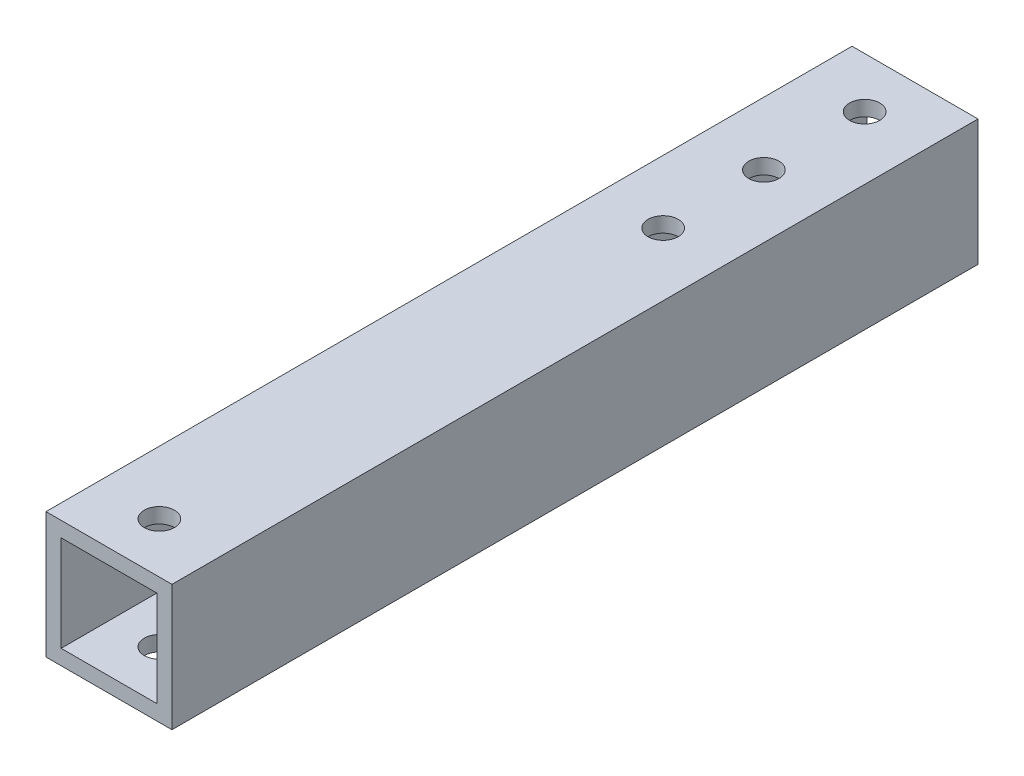
ISO-10303-21;
HEADER;
FILE_DESCRIPTION(('STEP AP214'),'2;1');
FILE_NAME('part.step','',(''),(''),'','','');
FILE_SCHEMA(('AUTOMOTIVE_DESIGN { 1 0 10303 214 1 1 1 1 }'));
ENDSEC;
DATA;
#1=APPLICATION_CONTEXT('core data for automotive mechanical design processes');
#2=APPLICATION_PROTOCOL_DEFINITION('international standard','automotive_design',2000,#1);
#3=PRODUCT_CONTEXT('',#1,'mechanical');
#4=PRODUCT('Part','Part','',(#3));
#5=PRODUCT_RELATED_PRODUCT_CATEGORY('part','',(#4));
#6=PRODUCT_DEFINITION_FORMATION('','',#4);
#7=PRODUCT_DEFINITION_CONTEXT('part definition',#1,'design');
#8=PRODUCT_DEFINITION('design','',#6,#7);
#9=PRODUCT_DEFINITION_SHAPE('','',#8);
#10=(LENGTH_UNIT() NAMED_UNIT(*) SI_UNIT(.MILLI.,.METRE.));
#11=(NAMED_UNIT(*) PLANE_ANGLE_UNIT() SI_UNIT($,.RADIAN.));
#12=(NAMED_UNIT(*) SI_UNIT($,.STERADIAN.) SOLID_ANGLE_UNIT());
#13=UNCERTAINTY_MEASURE_WITH_UNIT(LENGTH_MEASURE(1.E-05),#10,'distance_accuracy_value','');
#14=(GEOMETRIC_REPRESENTATION_CONTEXT(3) GLOBAL_UNCERTAINTY_ASSIGNED_CONTEXT((#13)) GLOBAL_UNIT_ASSIGNED_CONTEXT((#10,
#11,#12)) REPRESENTATION_CONTEXT('',''));
#15=CARTESIAN_POINT('',(0.,0.,0.));
#16=DIRECTION('',(0.,0.,1.));
#17=DIRECTION('',(1.,0.,0.));
#18=AXIS2_PLACEMENT_3D('',#15,#16,#17);
#19=CARTESIAN_POINT('',(0.,0.,160.));
#20=DIRECTION('',(0.,0.,-1.));
#21=DIRECTION('',(-1.,0.,0.));
#22=AXIS2_PLACEMENT_3D('',#19,#20,#21);
#23=PLANE('',#22);
#24=DIRECTION('',(0.,-1.,0.));
#25=VECTOR('',#24,1.);
#26=CARTESIAN_POINT('',(0.,0.,160.));
#27=LINE('',#26,#25);
#28=CARTESIAN_POINT('',(0.,25.,160.));
#29=VERTEX_POINT('',#28);
#30=CARTESIAN_POINT('',(0.,0.,160.));
#31=VERTEX_POINT('',#30);
#32=EDGE_CURVE('E157',#29,#31,#27,.T.);
#33=ORIENTED_EDGE('',*,*,#32,.T.);
#34=DIRECTION('',(1.,0.,0.));
#35=VECTOR('',#34,1.);
#36=CARTESIAN_POINT('',(0.,0.,160.));
#37=LINE('',#36,#35);
#38=CARTESIAN_POINT('',(25.,0.,160.));
#39=VERTEX_POINT('',#38);
#40=EDGE_CURVE('E161',#31,#39,#37,.T.);
#41=ORIENTED_EDGE('',*,*,#40,.T.);
#42=DIRECTION('',(0.,1.,0.));
#43=VECTOR('',#42,1.);
#44=CARTESIAN_POINT('',(25.,0.,160.));
#45=LINE('',#44,#43);
#46=CARTESIAN_POINT('',(25.,25.,160.));
#47=VERTEX_POINT('',#46);
#48=EDGE_CURVE('E165',#39,#47,#45,.T.);
#49=ORIENTED_EDGE('',*,*,#48,.T.);
#50=DIRECTION('',(-1.,0.,0.));
#51=VECTOR('',#50,1.);
#52=CARTESIAN_POINT('',(0.,25.,160.));
#53=LINE('',#52,#51);
#54=EDGE_CURVE('E168',#47,#29,#53,.T.);
#55=ORIENTED_EDGE('',*,*,#54,.T.);
#56=EDGE_LOOP('',(#33,#41,#49,#55));
#57=FACE_BOUND('',#56,.T.);
#58=DIRECTION('',(0.,-1.,0.));
#59=VECTOR('',#58,1.);
#60=CARTESIAN_POINT('',(3.,3.,160.));
#61=LINE('',#60,#59);
#62=CARTESIAN_POINT('',(3.,22.,160.));
#63=VERTEX_POINT('',#62);
#64=CARTESIAN_POINT('',(3.,3.,160.));
#65=VERTEX_POINT('',#64);
#66=EDGE_CURVE('E107',#63,#65,#61,.T.);
#67=ORIENTED_EDGE('',*,*,#66,.F.);
#68=DIRECTION('',(-1.,0.,0.));
#69=VECTOR('',#68,1.);
#70=CARTESIAN_POINT('',(3.,22.,160.));
#71=LINE('',#70,#69);
#72=CARTESIAN_POINT('',(22.,22.,160.));
#73=VERTEX_POINT('',#72);
#74=EDGE_CURVE('E133',#73,#63,#71,.T.);
#75=ORIENTED_EDGE('',*,*,#74,.F.);
#76=DIRECTION('',(0.,1.,0.));
#77=VECTOR('',#76,1.);
#78=CARTESIAN_POINT('',(22.,3.,160.));
#79=LINE('',#78,#77);
#80=CARTESIAN_POINT('',(22.,3.,160.));
#81=VERTEX_POINT('',#80);
#82=EDGE_CURVE('E129',#81,#73,#79,.T.);
#83=ORIENTED_EDGE('',*,*,#82,.F.);
#84=DIRECTION('',(1.,0.,0.));
#85=VECTOR('',#84,1.);
#86=CARTESIAN_POINT('',(3.,3.,160.));
#87=LINE('',#86,#85);
#88=EDGE_CURVE('E116',#65,#81,#87,.T.);
#89=ORIENTED_EDGE('',*,*,#88,.F.);
#90=EDGE_LOOP('',(#67,#75,#83,#89));
#91=FACE_BOUND('',#90,.T.);
#92=ADVANCED_FACE('F39',(#57,#91),#23,.F.);
#93=CARTESIAN_POINT('',(0.,0.,0.));
#94=DIRECTION('',(0.,0.,-1.));
#95=DIRECTION('',(-1.,0.,0.));
#96=AXIS2_PLACEMENT_3D('',#93,#94,#95);
#97=PLANE('',#96);
#98=DIRECTION('',(0.,-1.,0.));
#99=VECTOR('',#98,1.);
#100=CARTESIAN_POINT('',(0.,0.,0.));
#101=LINE('',#100,#99);
#102=CARTESIAN_POINT('',(0.,25.,0.));
#103=VERTEX_POINT('',#102);
#104=CARTESIAN_POINT('',(0.,0.,0.));
#105=VERTEX_POINT('',#104);
#106=EDGE_CURVE('E125',#103,#105,#101,.T.);
#107=ORIENTED_EDGE('',*,*,#106,.F.);
#108=DIRECTION('',(-1.,0.,0.));
#109=VECTOR('',#108,1.);
#110=CARTESIAN_POINT('',(0.,25.,0.));
#111=LINE('',#110,#109);
#112=CARTESIAN_POINT('',(25.,25.,0.));
#113=VERTEX_POINT('',#112);
#114=EDGE_CURVE('E162',#113,#103,#111,.T.);
#115=ORIENTED_EDGE('',*,*,#114,.F.);
#116=DIRECTION('',(0.,1.,0.));
#117=VECTOR('',#116,1.);
#118=CARTESIAN_POINT('',(25.,0.,0.));
#119=LINE('',#118,#117);
#120=CARTESIAN_POINT('',(25.,0.,0.));
#121=VERTEX_POINT('',#120);
#122=EDGE_CURVE('E178',#121,#113,#119,.T.);
#123=ORIENTED_EDGE('',*,*,#122,.F.);
#124=DIRECTION('',(1.,0.,0.));
#125=VECTOR('',#124,1.);
#126=CARTESIAN_POINT('',(0.,0.,0.));
#127=LINE('',#126,#125);
#128=EDGE_CURVE('E175',#105,#121,#127,.T.);
#129=ORIENTED_EDGE('',*,*,#128,.F.);
#130=EDGE_LOOP('',(#107,#115,#123,#129));
#131=FACE_BOUND('',#130,.T.);
#132=DIRECTION('',(-1.,0.,0.));
#133=VECTOR('',#132,1.);
#134=CARTESIAN_POINT('',(3.,22.,0.));
#135=LINE('',#134,#133);
#136=CARTESIAN_POINT('',(22.,22.,0.));
#137=VERTEX_POINT('',#136);
#138=CARTESIAN_POINT('',(3.,22.,0.));
#139=VERTEX_POINT('',#138);
#140=EDGE_CURVE('E117',#137,#139,#135,.T.);
#141=ORIENTED_EDGE('',*,*,#140,.T.);
#142=DIRECTION('',(0.,-1.,0.));
#143=VECTOR('',#142,1.);
#144=CARTESIAN_POINT('',(3.,3.,0.));
#145=LINE('',#144,#143);
#146=CARTESIAN_POINT('',(3.,3.,0.));
#147=VERTEX_POINT('',#146);
#148=EDGE_CURVE('E65',#139,#147,#145,.T.);
#149=ORIENTED_EDGE('',*,*,#148,.T.);
#150=DIRECTION('',(1.,0.,0.));
#151=VECTOR('',#150,1.);
#152=CARTESIAN_POINT('',(3.,3.,0.));
#153=LINE('',#152,#151);
#154=CARTESIAN_POINT('',(22.,3.,0.));
#155=VERTEX_POINT('',#154);
#156=EDGE_CURVE('E123',#147,#155,#153,.T.);
#157=ORIENTED_EDGE('',*,*,#156,.T.);
#158=DIRECTION('',(0.,1.,0.));
#159=VECTOR('',#158,1.);
#160=CARTESIAN_POINT('',(22.,3.,0.));
#161=LINE('',#160,#159);
#162=EDGE_CURVE('E144',#155,#137,#161,.T.);
#163=ORIENTED_EDGE('',*,*,#162,.T.);
#164=EDGE_LOOP('',(#141,#149,#157,#163));
#165=FACE_BOUND('',#164,.T.);
#166=ADVANCED_FACE('F242',(#131,#165),#97,.T.);
#167=CARTESIAN_POINT('',(0.,0.,160.));
#168=DIRECTION('',(1.,0.,0.));
#169=DIRECTION('',(0.,0.,-1.));
#170=AXIS2_PLACEMENT_3D('',#167,#168,#169);
#171=PLANE('',#170);
#172=ORIENTED_EDGE('',*,*,#106,.T.);
#173=DIRECTION('',(0.,0.,-1.));
#174=VECTOR('',#173,1.);
#175=CARTESIAN_POINT('',(0.,0.,160.));
#176=LINE('',#175,#174);
#177=EDGE_CURVE('E11',#31,#105,#176,.T.);
#178=ORIENTED_EDGE('',*,*,#177,.F.);
#179=ORIENTED_EDGE('',*,*,#32,.F.);
#180=DIRECTION('',(0.,0.,-1.));
#181=VECTOR('',#180,1.);
#182=CARTESIAN_POINT('',(0.,25.,160.));
#183=LINE('',#182,#181);
#184=EDGE_CURVE('E171',#29,#103,#183,.T.);
#185=ORIENTED_EDGE('',*,*,#184,.T.);
#186=EDGE_LOOP('',(#172,#178,#179,#185));
#187=FACE_BOUND('',#186,.T.);
#188=ADVANCED_FACE('F41',(#187),#171,.F.);
#189=CARTESIAN_POINT('',(0.,0.,160.));
#190=DIRECTION('',(0.,1.,0.));
#191=DIRECTION('',(0.,0.,1.));
#192=AXIS2_PLACEMENT_3D('',#189,#190,#191);
#193=PLANE('',#192);
#194=CARTESIAN_POINT('',(12.5,0.,10.));
#195=DIRECTION('',(0.,-1.,0.));
#196=DIRECTION('',(0.,0.,-1.));
#197=AXIS2_PLACEMENT_3D('',#194,#195,#196);
#198=CIRCLE('',#197,3.);
#199=CARTESIAN_POINT('',(12.5,0.,7.));
#200=VERTEX_POINT('',#199);
#201=EDGE_CURVE('E278',#200,#200,#198,.T.);
#202=ORIENTED_EDGE('',*,*,#201,.F.);
#203=EDGE_LOOP('',(#202));
#204=FACE_BOUND('',#203,.T.);
#205=CARTESIAN_POINT('',(12.5,0.,30.));
#206=DIRECTION('',(0.,-1.,0.));
#207=DIRECTION('',(0.,0.,-1.));
#208=AXIS2_PLACEMENT_3D('',#205,#206,#207);
#209=CIRCLE('',#208,3.);
#210=CARTESIAN_POINT('',(12.5,0.,27.));
#211=VERTEX_POINT('',#210);
#212=EDGE_CURVE('E282',#211,#211,#209,.T.);
#213=ORIENTED_EDGE('',*,*,#212,.F.);
#214=EDGE_LOOP('',(#213));
#215=FACE_BOUND('',#214,.T.);
#216=CARTESIAN_POINT('',(12.5,0.,50.));
#217=DIRECTION('',(0.,-1.,0.));
#218=DIRECTION('',(0.,0.,-1.));
#219=AXIS2_PLACEMENT_3D('',#216,#217,#218);
#220=CIRCLE('',#219,3.);
#221=CARTESIAN_POINT('',(12.5,0.,47.));
#222=VERTEX_POINT('',#221);
#223=EDGE_CURVE('E286',#222,#222,#220,.T.);
#224=ORIENTED_EDGE('',*,*,#223,.F.);
#225=EDGE_LOOP('',(#224));
#226=FACE_BOUND('',#225,.T.);
#227=CARTESIAN_POINT('',(12.5,0.,150.));
#228=DIRECTION('',(0.,-1.,0.));
#229=DIRECTION('',(0.,0.,-1.));
#230=AXIS2_PLACEMENT_3D('',#227,#228,#229);
#231=CIRCLE('',#230,3.);
#232=CARTESIAN_POINT('',(12.5,0.,147.));
#233=VERTEX_POINT('',#232);
#234=EDGE_CURVE('E290',#233,#233,#231,.T.);
#235=ORIENTED_EDGE('',*,*,#234,.F.);
#236=EDGE_LOOP('',(#235));
#237=FACE_BOUND('',#236,.T.);
#238=ORIENTED_EDGE('',*,*,#128,.T.);
#239=DIRECTION('',(0.,0.,-1.));
#240=VECTOR('',#239,1.);
#241=CARTESIAN_POINT('',(25.,0.,160.));
#242=LINE('',#241,#240);
#243=EDGE_CURVE('E49',#39,#121,#242,.T.);
#244=ORIENTED_EDGE('',*,*,#243,.F.);
#245=ORIENTED_EDGE('',*,*,#40,.F.);
#246=ORIENTED_EDGE('',*,*,#177,.T.);
#247=EDGE_LOOP('',(#238,#244,#245,#246));
#248=FACE_BOUND('',#247,.T.);
#249=ADVANCED_FACE('F267',(#204,#215,#226,#237,#248),#193,.F.);
#250=CARTESIAN_POINT('',(25.,0.,160.));
#251=DIRECTION('',(-1.,0.,0.));
#252=DIRECTION('',(0.,0.,1.));
#253=AXIS2_PLACEMENT_3D('',#250,#251,#252);
#254=PLANE('',#253);
#255=ORIENTED_EDGE('',*,*,#122,.T.);
#256=DIRECTION('',(0.,0.,-1.));
#257=VECTOR('',#256,1.);
#258=CARTESIAN_POINT('',(25.,25.,160.));
#259=LINE('',#258,#257);
#260=EDGE_CURVE('E186',#47,#113,#259,.T.);
#261=ORIENTED_EDGE('',*,*,#260,.F.);
#262=ORIENTED_EDGE('',*,*,#48,.F.);
#263=ORIENTED_EDGE('',*,*,#243,.T.);
#264=EDGE_LOOP('',(#255,#261,#262,#263));
#265=FACE_BOUND('',#264,.T.);
#266=ADVANCED_FACE('F264',(#265),#254,.F.);
#267=CARTESIAN_POINT('',(0.,25.,160.));
#268=DIRECTION('',(0.,-1.,0.));
#269=DIRECTION('',(0.,0.,-1.));
#270=AXIS2_PLACEMENT_3D('',#267,#268,#269);
#271=PLANE('',#270);
#272=CARTESIAN_POINT('',(12.5,25.,10.));
#273=DIRECTION('',(0.,-1.,0.));
#274=DIRECTION('',(0.,0.,-1.));
#275=AXIS2_PLACEMENT_3D('',#272,#273,#274);
#276=CIRCLE('',#275,3.);
#277=CARTESIAN_POINT('',(12.5,25.,7.));
#278=VERTEX_POINT('',#277);
#279=EDGE_CURVE('E198',#278,#278,#276,.T.);
#280=ORIENTED_EDGE('',*,*,#279,.T.);
#281=EDGE_LOOP('',(#280));
#282=FACE_BOUND('',#281,.T.);
#283=CARTESIAN_POINT('',(12.5,25.,30.));
#284=DIRECTION('',(0.,-1.,0.));
#285=DIRECTION('',(0.,0.,-1.));
#286=AXIS2_PLACEMENT_3D('',#283,#284,#285);
#287=CIRCLE('',#286,3.);
#288=CARTESIAN_POINT('',(12.5,25.,27.));
#289=VERTEX_POINT('',#288);
#290=EDGE_CURVE('E317',#289,#289,#287,.T.);
#291=ORIENTED_EDGE('',*,*,#290,.T.);
#292=EDGE_LOOP('',(#291));
#293=FACE_BOUND('',#292,.T.);
#294=CARTESIAN_POINT('',(12.5,25.,50.));
#295=DIRECTION('',(0.,-1.,0.));
#296=DIRECTION('',(0.,0.,-1.));
#297=AXIS2_PLACEMENT_3D('',#294,#295,#296);
#298=CIRCLE('',#297,3.);
#299=CARTESIAN_POINT('',(12.5,25.,47.));
#300=VERTEX_POINT('',#299);
#301=EDGE_CURVE('E311',#300,#300,#298,.T.);
#302=ORIENTED_EDGE('',*,*,#301,.T.);
#303=EDGE_LOOP('',(#302));
#304=FACE_BOUND('',#303,.T.);
#305=CARTESIAN_POINT('',(12.5,25.,150.));
#306=DIRECTION('',(0.,-1.,0.));
#307=DIRECTION('',(0.,0.,-1.));
#308=AXIS2_PLACEMENT_3D('',#305,#306,#307);
#309=CIRCLE('',#308,3.);
#310=CARTESIAN_POINT('',(12.5,25.,147.));
#311=VERTEX_POINT('',#310);
#312=EDGE_CURVE('E304',#311,#311,#309,.T.);
#313=ORIENTED_EDGE('',*,*,#312,.T.);
#314=EDGE_LOOP('',(#313));
#315=FACE_BOUND('',#314,.T.);
#316=ORIENTED_EDGE('',*,*,#114,.T.);
#317=ORIENTED_EDGE('',*,*,#184,.F.);
#318=ORIENTED_EDGE('',*,*,#54,.F.);
#319=ORIENTED_EDGE('',*,*,#260,.T.);
#320=EDGE_LOOP('',(#316,#317,#318,#319));
#321=FACE_BOUND('',#320,.T.);
#322=ADVANCED_FACE('F261',(#282,#293,#304,#315,#321),#271,.F.);
#323=CARTESIAN_POINT('',(3.,3.,160.));
#324=DIRECTION('',(1.,0.,0.));
#325=DIRECTION('',(0.,0.,-1.));
#326=AXIS2_PLACEMENT_3D('',#323,#324,#325);
#327=PLANE('',#326);
#328=ORIENTED_EDGE('',*,*,#148,.F.);
#329=DIRECTION('',(0.,0.,-1.));
#330=VECTOR('',#329,1.);
#331=CARTESIAN_POINT('',(3.,22.,160.));
#332=LINE('',#331,#330);
#333=EDGE_CURVE('E111',#63,#139,#332,.T.);
#334=ORIENTED_EDGE('',*,*,#333,.F.);
#335=ORIENTED_EDGE('',*,*,#66,.T.);
#336=DIRECTION('',(0.,0.,-1.));
#337=VECTOR('',#336,1.);
#338=CARTESIAN_POINT('',(3.,3.,160.));
#339=LINE('',#338,#337);
#340=EDGE_CURVE('E110',#65,#147,#339,.T.);
#341=ORIENTED_EDGE('',*,*,#340,.T.);
#342=EDGE_LOOP('',(#328,#334,#335,#341));
#343=FACE_BOUND('',#342,.T.);
#344=ADVANCED_FACE('F109',(#343),#327,.T.);
#345=CARTESIAN_POINT('',(3.,3.,160.));
#346=DIRECTION('',(0.,1.,0.));
#347=DIRECTION('',(0.,0.,1.));
#348=AXIS2_PLACEMENT_3D('',#345,#346,#347);
#349=PLANE('',#348);
#350=CARTESIAN_POINT('',(12.5,3.,10.));
#351=DIRECTION('',(0.,1.,0.));
#352=DIRECTION('',(0.,0.,1.));
#353=AXIS2_PLACEMENT_3D('',#350,#351,#352);
#354=CIRCLE('',#353,3.);
#355=CARTESIAN_POINT('',(12.5,3.,13.));
#356=VERTEX_POINT('',#355);
#357=EDGE_CURVE('E141',#356,#356,#354,.T.);
#358=ORIENTED_EDGE('',*,*,#357,.F.);
#359=EDGE_LOOP('',(#358));
#360=FACE_BOUND('',#359,.T.);
#361=CARTESIAN_POINT('',(12.5,3.,30.));
#362=DIRECTION('',(0.,1.,0.));
#363=DIRECTION('',(0.,0.,1.));
#364=AXIS2_PLACEMENT_3D('',#361,#362,#363);
#365=CIRCLE('',#364,3.);
#366=CARTESIAN_POINT('',(12.5,3.,33.));
#367=VERTEX_POINT('',#366);
#368=EDGE_CURVE('E206',#367,#367,#365,.T.);
#369=ORIENTED_EDGE('',*,*,#368,.F.);
#370=EDGE_LOOP('',(#369));
#371=FACE_BOUND('',#370,.T.);
#372=CARTESIAN_POINT('',(12.5,3.,50.));
#373=DIRECTION('',(0.,1.,0.));
#374=DIRECTION('',(0.,0.,1.));
#375=AXIS2_PLACEMENT_3D('',#372,#373,#374);
#376=CIRCLE('',#375,3.);
#377=CARTESIAN_POINT('',(12.5,3.,53.));
#378=VERTEX_POINT('',#377);
#379=EDGE_CURVE('E202',#378,#378,#376,.T.);
#380=ORIENTED_EDGE('',*,*,#379,.F.);
#381=EDGE_LOOP('',(#380));
#382=FACE_BOUND('',#381,.T.);
#383=CARTESIAN_POINT('',(12.5,3.,150.));
#384=DIRECTION('',(0.,1.,0.));
#385=DIRECTION('',(0.,0.,1.));
#386=AXIS2_PLACEMENT_3D('',#383,#384,#385);
#387=CIRCLE('',#386,3.);
#388=CARTESIAN_POINT('',(12.5,3.,153.));
#389=VERTEX_POINT('',#388);
#390=EDGE_CURVE('E197',#389,#389,#387,.T.);
#391=ORIENTED_EDGE('',*,*,#390,.F.);
#392=EDGE_LOOP('',(#391));
#393=FACE_BOUND('',#392,.T.);
#394=ORIENTED_EDGE('',*,*,#156,.F.);
#395=ORIENTED_EDGE('',*,*,#340,.F.);
#396=ORIENTED_EDGE('',*,*,#88,.T.);
#397=DIRECTION('',(0.,0.,-1.));
#398=VECTOR('',#397,1.);
#399=CARTESIAN_POINT('',(22.,3.,160.));
#400=LINE('',#399,#398);
#401=EDGE_CURVE('E126',#81,#155,#400,.T.);
#402=ORIENTED_EDGE('',*,*,#401,.T.);
#403=EDGE_LOOP('',(#394,#395,#396,#402));
#404=FACE_BOUND('',#403,.T.);
#405=ADVANCED_FACE('F120',(#360,#371,#382,#393,#404),#349,.T.);
#406=CARTESIAN_POINT('',(22.,3.,160.));
#407=DIRECTION('',(-1.,0.,0.));
#408=DIRECTION('',(0.,0.,1.));
#409=AXIS2_PLACEMENT_3D('',#406,#407,#408);
#410=PLANE('',#409);
#411=ORIENTED_EDGE('',*,*,#162,.F.);
#412=ORIENTED_EDGE('',*,*,#401,.F.);
#413=ORIENTED_EDGE('',*,*,#82,.T.);
#414=DIRECTION('',(0.,0.,-1.));
#415=VECTOR('',#414,1.);
#416=CARTESIAN_POINT('',(22.,22.,160.));
#417=LINE('',#416,#415);
#418=EDGE_CURVE('E57',#73,#137,#417,.T.);
#419=ORIENTED_EDGE('',*,*,#418,.T.);
#420=EDGE_LOOP('',(#411,#412,#413,#419));
#421=FACE_BOUND('',#420,.T.);
#422=ADVANCED_FACE('F234',(#421),#410,.T.);
#423=CARTESIAN_POINT('',(3.,22.,160.));
#424=DIRECTION('',(0.,-1.,0.));
#425=DIRECTION('',(0.,0.,-1.));
#426=AXIS2_PLACEMENT_3D('',#423,#424,#425);
#427=PLANE('',#426);
#428=CARTESIAN_POINT('',(12.5,22.,10.));
#429=DIRECTION('',(0.,-1.,0.));
#430=DIRECTION('',(0.,0.,-1.));
#431=AXIS2_PLACEMENT_3D('',#428,#429,#430);
#432=CIRCLE('',#431,3.);
#433=CARTESIAN_POINT('',(12.5,22.,7.));
#434=VERTEX_POINT('',#433);
#435=EDGE_CURVE('E43',#434,#434,#432,.T.);
#436=ORIENTED_EDGE('',*,*,#435,.F.);
#437=EDGE_LOOP('',(#436));
#438=FACE_BOUND('',#437,.T.);
#439=CARTESIAN_POINT('',(12.5,22.,30.));
#440=DIRECTION('',(0.,-1.,0.));
#441=DIRECTION('',(0.,0.,-1.));
#442=AXIS2_PLACEMENT_3D('',#439,#440,#441);
#443=CIRCLE('',#442,3.);
#444=CARTESIAN_POINT('',(12.5,22.,27.));
#445=VERTEX_POINT('',#444);
#446=EDGE_CURVE('E203',#445,#445,#443,.T.);
#447=ORIENTED_EDGE('',*,*,#446,.F.);
#448=EDGE_LOOP('',(#447));
#449=FACE_BOUND('',#448,.T.);
#450=CARTESIAN_POINT('',(12.5,22.,50.));
#451=DIRECTION('',(0.,-1.,0.));
#452=DIRECTION('',(0.,0.,-1.));
#453=AXIS2_PLACEMENT_3D('',#450,#451,#452);
#454=CIRCLE('',#453,3.);
#455=CARTESIAN_POINT('',(12.5,22.,47.));
#456=VERTEX_POINT('',#455);
#457=EDGE_CURVE('E199',#456,#456,#454,.T.);
#458=ORIENTED_EDGE('',*,*,#457,.F.);
#459=EDGE_LOOP('',(#458));
#460=FACE_BOUND('',#459,.T.);
#461=CARTESIAN_POINT('',(12.5,22.,150.));
#462=DIRECTION('',(0.,-1.,0.));
#463=DIRECTION('',(0.,0.,-1.));
#464=AXIS2_PLACEMENT_3D('',#461,#462,#463);
#465=CIRCLE('',#464,3.);
#466=CARTESIAN_POINT('',(12.5,22.,147.));
#467=VERTEX_POINT('',#466);
#468=EDGE_CURVE('E193',#467,#467,#465,.T.);
#469=ORIENTED_EDGE('',*,*,#468,.F.);
#470=EDGE_LOOP('',(#469));
#471=FACE_BOUND('',#470,.T.);
#472=ORIENTED_EDGE('',*,*,#140,.F.);
#473=ORIENTED_EDGE('',*,*,#418,.F.);
#474=ORIENTED_EDGE('',*,*,#74,.T.);
#475=ORIENTED_EDGE('',*,*,#333,.T.);
#476=EDGE_LOOP('',(#472,#473,#474,#475));
#477=FACE_BOUND('',#476,.T.);
#478=ADVANCED_FACE('F230',(#438,#449,#460,#471,#477),#427,.T.);
#479=CARTESIAN_POINT('',(12.5,25.,150.));
#480=DIRECTION('',(0.,-1.,0.));
#481=DIRECTION('',(0.,0.,-1.));
#482=AXIS2_PLACEMENT_3D('',#479,#480,#481);
#483=CYLINDRICAL_SURFACE('',#482,3.);
#484=ORIENTED_EDGE('',*,*,#468,.T.);
#485=EDGE_LOOP('',(#484));
#486=FACE_BOUND('',#485,.T.);
#487=ORIENTED_EDGE('',*,*,#312,.F.);
#488=EDGE_LOOP('',(#487));
#489=FACE_BOUND('',#488,.T.);
#490=ADVANCED_FACE('F233',(#486,#489),#483,.F.);
#491=CARTESIAN_POINT('',(12.5,25.,50.));
#492=DIRECTION('',(0.,-1.,0.));
#493=DIRECTION('',(0.,0.,-1.));
#494=AXIS2_PLACEMENT_3D('',#491,#492,#493);
#495=CYLINDRICAL_SURFACE('',#494,3.);
#496=ORIENTED_EDGE('',*,*,#457,.T.);
#497=EDGE_LOOP('',(#496));
#498=FACE_BOUND('',#497,.T.);
#499=ORIENTED_EDGE('',*,*,#301,.F.);
#500=EDGE_LOOP('',(#499));
#501=FACE_BOUND('',#500,.T.);
#502=ADVANCED_FACE('F339',(#498,#501),#495,.F.);
#503=CARTESIAN_POINT('',(12.5,25.,30.));
#504=DIRECTION('',(0.,-1.,0.));
#505=DIRECTION('',(0.,0.,-1.));
#506=AXIS2_PLACEMENT_3D('',#503,#504,#505);
#507=CYLINDRICAL_SURFACE('',#506,3.);
#508=ORIENTED_EDGE('',*,*,#446,.T.);
#509=EDGE_LOOP('',(#508));
#510=FACE_BOUND('',#509,.T.);
#511=ORIENTED_EDGE('',*,*,#290,.F.);
#512=EDGE_LOOP('',(#511));
#513=FACE_BOUND('',#512,.T.);
#514=ADVANCED_FACE('F329',(#510,#513),#507,.F.);
#515=CARTESIAN_POINT('',(12.5,25.,10.));
#516=DIRECTION('',(0.,-1.,0.));
#517=DIRECTION('',(0.,0.,-1.));
#518=AXIS2_PLACEMENT_3D('',#515,#516,#517);
#519=CYLINDRICAL_SURFACE('',#518,3.);
#520=ORIENTED_EDGE('',*,*,#435,.T.);
#521=EDGE_LOOP('',(#520));
#522=FACE_BOUND('',#521,.T.);
#523=ORIENTED_EDGE('',*,*,#279,.F.);
#524=EDGE_LOOP('',(#523));
#525=FACE_BOUND('',#524,.T.);
#526=ADVANCED_FACE('F227',(#522,#525),#519,.F.);
#527=ORIENTED_EDGE('',*,*,#390,.T.);
#528=EDGE_LOOP('',(#527));
#529=FACE_BOUND('',#528,.T.);
#530=ORIENTED_EDGE('',*,*,#234,.T.);
#531=EDGE_LOOP('',(#530));
#532=FACE_BOUND('',#531,.T.);
#533=ADVANCED_FACE('F328',(#529,#532),#483,.F.);
#534=ORIENTED_EDGE('',*,*,#379,.T.);
#535=EDGE_LOOP('',(#534));
#536=FACE_BOUND('',#535,.T.);
#537=ORIENTED_EDGE('',*,*,#223,.T.);
#538=EDGE_LOOP('',(#537));
#539=FACE_BOUND('',#538,.T.);
#540=ADVANCED_FACE('F336',(#536,#539),#495,.F.);
#541=ORIENTED_EDGE('',*,*,#368,.T.);
#542=EDGE_LOOP('',(#541));
#543=FACE_BOUND('',#542,.T.);
#544=ORIENTED_EDGE('',*,*,#212,.T.);
#545=EDGE_LOOP('',(#544));
#546=FACE_BOUND('',#545,.T.);
#547=ADVANCED_FACE('F341',(#543,#546),#507,.F.);
#548=ORIENTED_EDGE('',*,*,#357,.T.);
#549=EDGE_LOOP('',(#548));
#550=FACE_BOUND('',#549,.T.);
#551=ORIENTED_EDGE('',*,*,#201,.T.);
#552=EDGE_LOOP('',(#551));
#553=FACE_BOUND('',#552,.T.);
#554=ADVANCED_FACE('F331',(#550,#553),#519,.F.);
#555=CLOSED_SHELL('',(#92,#166,#188,#249,#266,#322,#344,#405,#422,#478,#490,#502,#514,#526,#533,
#540,#547,#554));
#556=MANIFOLD_SOLID_BREP('B2',#555);
#557=ADVANCED_BREP_SHAPE_REPRESENTATION('',(#18,#556),#14);
#558=SHAPE_DEFINITION_REPRESENTATION(#9,#557);
ENDSEC;
END-ISO-10303-21;
